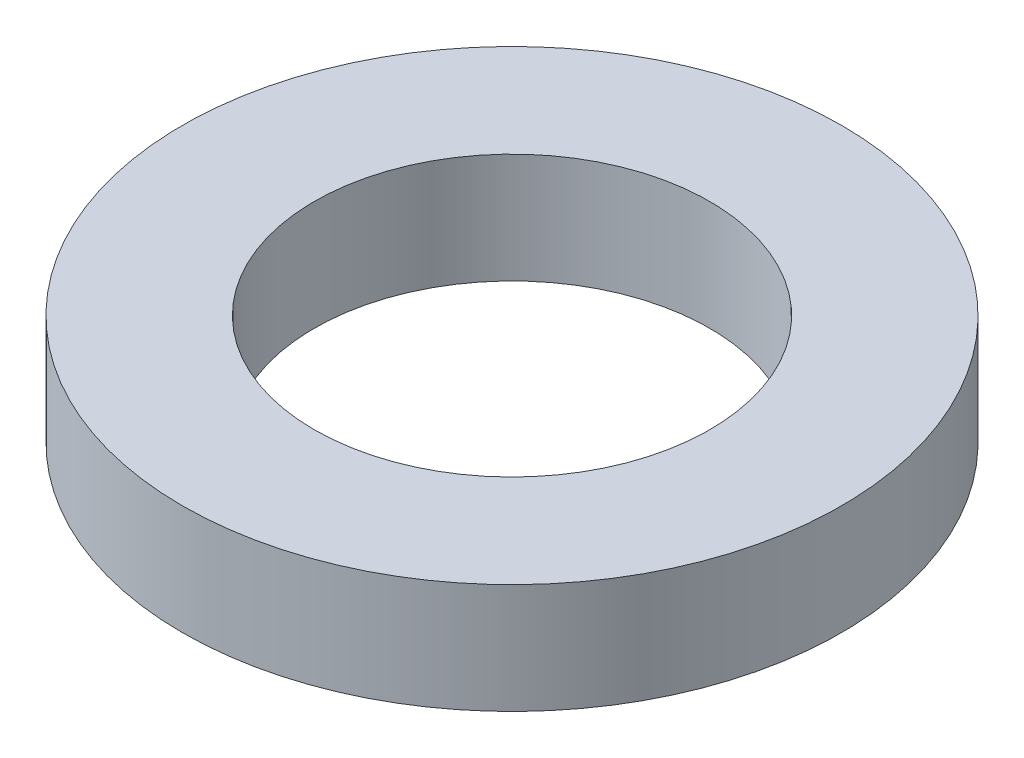
ISO-10303-21;
HEADER;
FILE_DESCRIPTION(('STEP AP214'),'2;1');
FILE_NAME('part.step','',(''),(''),'','','');
FILE_SCHEMA(('AUTOMOTIVE_DESIGN { 1 0 10303 214 1 1 1 1 }'));
ENDSEC;
DATA;
#1=APPLICATION_CONTEXT('core data for automotive mechanical design processes');
#2=APPLICATION_PROTOCOL_DEFINITION('international standard','automotive_design',2000,#1);
#3=PRODUCT_CONTEXT('',#1,'mechanical');
#4=PRODUCT('Part','Part','',(#3));
#5=PRODUCT_RELATED_PRODUCT_CATEGORY('part','',(#4));
#6=PRODUCT_DEFINITION_FORMATION('','',#4);
#7=PRODUCT_DEFINITION_CONTEXT('part definition',#1,'design');
#8=PRODUCT_DEFINITION('design','',#6,#7);
#9=PRODUCT_DEFINITION_SHAPE('','',#8);
#10=(LENGTH_UNIT() NAMED_UNIT(*) SI_UNIT(.MILLI.,.METRE.));
#11=(NAMED_UNIT(*) PLANE_ANGLE_UNIT() SI_UNIT($,.RADIAN.));
#12=(NAMED_UNIT(*) SI_UNIT($,.STERADIAN.) SOLID_ANGLE_UNIT());
#13=UNCERTAINTY_MEASURE_WITH_UNIT(LENGTH_MEASURE(1.E-05),#10,'distance_accuracy_value','');
#14=(GEOMETRIC_REPRESENTATION_CONTEXT(3) GLOBAL_UNCERTAINTY_ASSIGNED_CONTEXT((#13)) GLOBAL_UNIT_ASSIGNED_CONTEXT((#10,
#11,#12)) REPRESENTATION_CONTEXT('',''));
#15=CARTESIAN_POINT('',(0.,0.,0.));
#16=DIRECTION('',(0.,0.,1.));
#17=DIRECTION('',(1.,0.,0.));
#18=AXIS2_PLACEMENT_3D('',#15,#16,#17);
#19=CARTESIAN_POINT('',(0.,25.,0.));
#20=DIRECTION('',(0.,-1.,0.));
#21=DIRECTION('',(0.,0.,-1.));
#22=AXIS2_PLACEMENT_3D('',#19,#20,#21);
#23=CYLINDRICAL_SURFACE('',#22,75.);
#24=CARTESIAN_POINT('',(0.,25.,0.));
#25=DIRECTION('',(0.,1.,0.));
#26=DIRECTION('',(0.,0.,1.));
#27=AXIS2_PLACEMENT_3D('',#24,#25,#26);
#28=CIRCLE('',#27,75.);
#29=CARTESIAN_POINT('',(0.,25.,75.));
#30=VERTEX_POINT('',#29);
#31=EDGE_CURVE('E10',#30,#30,#28,.T.);
#32=ORIENTED_EDGE('',*,*,#31,.F.);
#33=EDGE_LOOP('',(#32));
#34=FACE_BOUND('',#33,.T.);
#35=CARTESIAN_POINT('',(0.,0.,0.));
#36=DIRECTION('',(0.,1.,0.));
#37=DIRECTION('',(0.,0.,1.));
#38=AXIS2_PLACEMENT_3D('',#35,#36,#37);
#39=CIRCLE('',#38,75.);
#40=CARTESIAN_POINT('',(0.,0.,75.));
#41=VERTEX_POINT('',#40);
#42=EDGE_CURVE('E37',#41,#41,#39,.T.);
#43=ORIENTED_EDGE('',*,*,#42,.T.);
#44=EDGE_LOOP('',(#43));
#45=FACE_BOUND('',#44,.T.);
#46=ADVANCED_FACE('F40',(#34,#45),#23,.T.);
#47=CARTESIAN_POINT('',(0.,25.,0.));
#48=DIRECTION('',(0.,1.,0.));
#49=DIRECTION('',(0.,0.,1.));
#50=AXIS2_PLACEMENT_3D('',#47,#48,#49);
#51=PLANE('',#50);
#52=CARTESIAN_POINT('',(0.,25.,0.));
#53=DIRECTION('',(0.,1.,0.));
#54=DIRECTION('',(0.,0.,1.));
#55=AXIS2_PLACEMENT_3D('',#52,#53,#54);
#56=CIRCLE('',#55,45.);
#57=CARTESIAN_POINT('',(0.,25.,45.));
#58=VERTEX_POINT('',#57);
#59=EDGE_CURVE('E50',#58,#58,#56,.T.);
#60=ORIENTED_EDGE('',*,*,#59,.F.);
#61=EDGE_LOOP('',(#60));
#62=FACE_BOUND('',#61,.T.);
#63=ORIENTED_EDGE('',*,*,#31,.T.);
#64=EDGE_LOOP('',(#63));
#65=FACE_BOUND('',#64,.T.);
#66=ADVANCED_FACE('F59',(#62,#65),#51,.T.);
#67=CARTESIAN_POINT('',(0.,0.,0.));
#68=DIRECTION('',(0.,1.,0.));
#69=DIRECTION('',(0.,0.,1.));
#70=AXIS2_PLACEMENT_3D('',#67,#68,#69);
#71=PLANE('',#70);
#72=CARTESIAN_POINT('',(0.,0.,0.));
#73=DIRECTION('',(0.,1.,0.));
#74=DIRECTION('',(0.,0.,1.));
#75=AXIS2_PLACEMENT_3D('',#72,#73,#74);
#76=CIRCLE('',#75,45.);
#77=CARTESIAN_POINT('',(0.,0.,45.));
#78=VERTEX_POINT('',#77);
#79=EDGE_CURVE('E47',#78,#78,#76,.T.);
#80=ORIENTED_EDGE('',*,*,#79,.T.);
#81=EDGE_LOOP('',(#80));
#82=FACE_BOUND('',#81,.T.);
#83=ORIENTED_EDGE('',*,*,#42,.F.);
#84=EDGE_LOOP('',(#83));
#85=FACE_BOUND('',#84,.T.);
#86=ADVANCED_FACE('F58',(#82,#85),#71,.F.);
#87=CARTESIAN_POINT('',(0.,25.,0.));
#88=DIRECTION('',(0.,-1.,0.));
#89=DIRECTION('',(0.,0.,-1.));
#90=AXIS2_PLACEMENT_3D('',#87,#88,#89);
#91=CYLINDRICAL_SURFACE('',#90,45.);
#92=ORIENTED_EDGE('',*,*,#59,.T.);
#93=EDGE_LOOP('',(#92));
#94=FACE_BOUND('',#93,.T.);
#95=ORIENTED_EDGE('',*,*,#79,.F.);
#96=EDGE_LOOP('',(#95));
#97=FACE_BOUND('',#96,.T.);
#98=ADVANCED_FACE('F54',(#94,#97),#91,.F.);
#99=CLOSED_SHELL('',(#46,#66,#86,#98));
#100=MANIFOLD_SOLID_BREP('B2',#99);
#101=ADVANCED_BREP_SHAPE_REPRESENTATION('',(#18,#100),#14);
#102=SHAPE_DEFINITION_REPRESENTATION(#9,#101);
ENDSEC;
END-ISO-10303-21;
